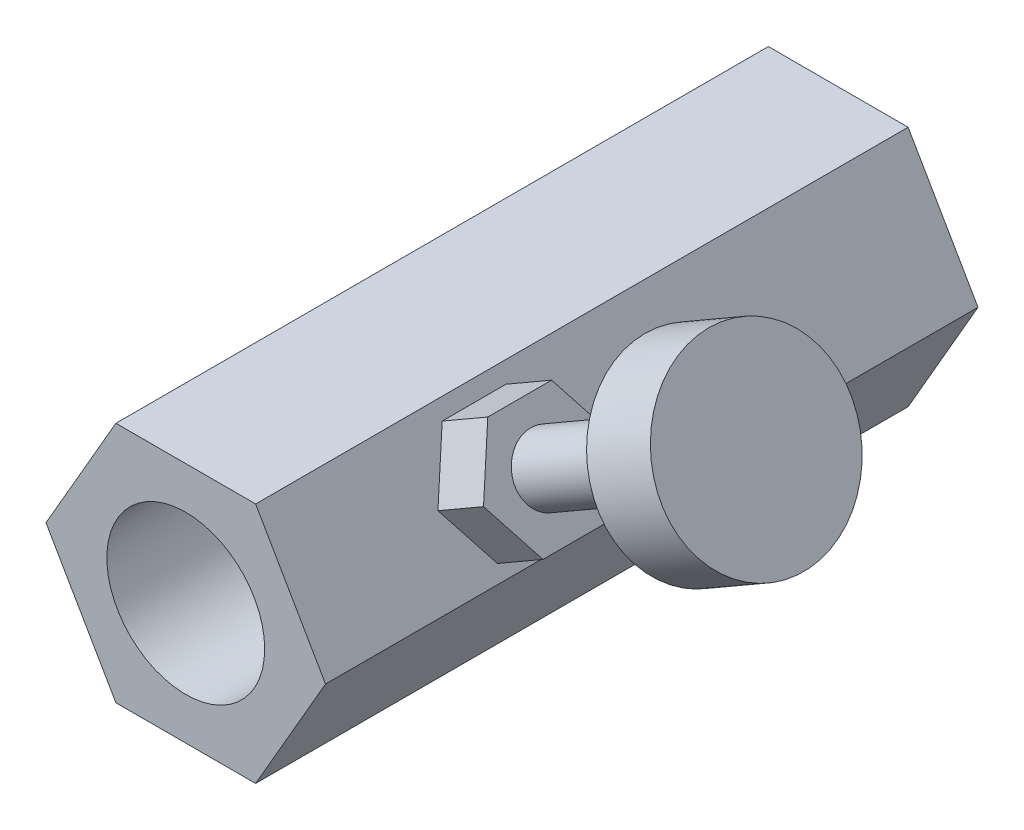
ISO-10303-21;
HEADER;
FILE_DESCRIPTION(('STEP AP214'),'2;1');
FILE_NAME('part.step','',(''),(''),'','','');
FILE_SCHEMA(('AUTOMOTIVE_DESIGN { 1 0 10303 214 1 1 1 1 }'));
ENDSEC;
DATA;
#1=APPLICATION_CONTEXT('core data for automotive mechanical design processes');
#2=APPLICATION_PROTOCOL_DEFINITION('international standard','automotive_design',2000,#1);
#3=PRODUCT_CONTEXT('',#1,'mechanical');
#4=PRODUCT('Part','Part','',(#3));
#5=PRODUCT_RELATED_PRODUCT_CATEGORY('part','',(#4));
#6=PRODUCT_DEFINITION_FORMATION('','',#4);
#7=PRODUCT_DEFINITION_CONTEXT('part definition',#1,'design');
#8=PRODUCT_DEFINITION('design','',#6,#7);
#9=PRODUCT_DEFINITION_SHAPE('','',#8);
#10=(LENGTH_UNIT() NAMED_UNIT(*) SI_UNIT(.MILLI.,.METRE.));
#11=(NAMED_UNIT(*) PLANE_ANGLE_UNIT() SI_UNIT($,.RADIAN.));
#12=(NAMED_UNIT(*) SI_UNIT($,.STERADIAN.) SOLID_ANGLE_UNIT());
#13=UNCERTAINTY_MEASURE_WITH_UNIT(LENGTH_MEASURE(1.E-05),#10,'distance_accuracy_value','');
#14=(GEOMETRIC_REPRESENTATION_CONTEXT(3) GLOBAL_UNCERTAINTY_ASSIGNED_CONTEXT((#13)) GLOBAL_UNIT_ASSIGNED_CONTEXT((#10,
#11,#12)) REPRESENTATION_CONTEXT('',''));
#15=CARTESIAN_POINT('',(0.,0.,0.));
#16=DIRECTION('',(0.,0.,1.));
#17=DIRECTION('',(1.,0.,0.));
#18=AXIS2_PLACEMENT_3D('',#15,#16,#17);
#19=CARTESIAN_POINT('',(-13.2790561913614,0.,-42.));
#20=DIRECTION('',(-0.866025403784439,-0.5,0.));
#21=DIRECTION('',(0.5,-0.866025403784439,0.));
#22=AXIS2_PLACEMENT_3D('',#19,#20,#21);
#23=PLANE('',#22);
#24=DIRECTION('',(0.,0.,1.));
#25=VECTOR('',#24,1.);
#26=CARTESIAN_POINT('',(-6.6395280956807,-11.5,-42.));
#27=LINE('',#26,#25);
#28=CARTESIAN_POINT('',(-6.6395280956807,-11.5,-42.));
#29=VERTEX_POINT('',#28);
#30=CARTESIAN_POINT('',(-6.6395280956807,-11.5,20.));
#31=VERTEX_POINT('',#30);
#32=EDGE_CURVE('E34',#29,#31,#27,.T.);
#33=ORIENTED_EDGE('',*,*,#32,.T.);
#34=DIRECTION('',(0.5,-0.866025403784439,0.));
#35=VECTOR('',#34,1.);
#36=CARTESIAN_POINT('',(-13.2790561913614,0.,20.));
#37=LINE('',#36,#35);
#38=CARTESIAN_POINT('',(-13.2790561913614,0.,20.));
#39=VERTEX_POINT('',#38);
#40=EDGE_CURVE('E246',#39,#31,#37,.T.);
#41=ORIENTED_EDGE('',*,*,#40,.F.);
#42=DIRECTION('',(0.,0.,1.));
#43=VECTOR('',#42,1.);
#44=CARTESIAN_POINT('',(-13.2790561913614,0.,-42.));
#45=LINE('',#44,#43);
#46=CARTESIAN_POINT('',(-13.2790561913614,0.,-42.));
#47=VERTEX_POINT('',#46);
#48=EDGE_CURVE('E11',#47,#39,#45,.T.);
#49=ORIENTED_EDGE('',*,*,#48,.F.);
#50=DIRECTION('',(0.5,-0.866025403784439,0.));
#51=VECTOR('',#50,1.);
#52=CARTESIAN_POINT('',(-13.2790561913614,0.,-42.));
#53=LINE('',#52,#51);
#54=EDGE_CURVE('E264',#47,#29,#53,.T.);
#55=ORIENTED_EDGE('',*,*,#54,.T.);
#56=EDGE_LOOP('',(#33,#41,#49,#55));
#57=FACE_BOUND('',#56,.T.);
#58=DIRECTION('',(0.,0.,1.));
#59=VECTOR('',#58,1.);
#60=CARTESIAN_POINT('',(-7.22929214352105,-10.478498704663,-16.7322101021105));
#61=LINE('',#60,#59);
#62=CARTESIAN_POINT('',(-7.22929214352105,-10.478498704663,-16.7322101021105));
#63=VERTEX_POINT('',#62);
#64=CARTESIAN_POINT('',(-7.22929214352105,-10.478498704663,-10.4275451625598));
#65=VERTEX_POINT('',#64);
#66=EDGE_CURVE('E558',#63,#65,#61,.T.);
#67=ORIENTED_EDGE('',*,*,#66,.F.);
#68=DIRECTION('',(0.433012701892219,-0.75,0.5));
#69=VECTOR('',#68,1.);
#70=CARTESIAN_POINT('',(-9.95929214352105,-5.75,-19.8845425718858));
#71=LINE('',#70,#69);
#72=CARTESIAN_POINT('',(-9.95929214352105,-5.75,-19.8845425718858));
#73=VERTEX_POINT('',#72);
#74=EDGE_CURVE('E180',#73,#63,#71,.T.);
#75=ORIENTED_EDGE('',*,*,#74,.F.);
#76=DIRECTION('',(0.433012701892219,-0.75,-0.5));
#77=VECTOR('',#76,1.);
#78=CARTESIAN_POINT('',(-12.6892921435211,-1.02150129533697,-16.7322101021105));
#79=LINE('',#78,#77);
#80=CARTESIAN_POINT('',(-12.689292143521,-1.02150129533697,-16.7322101021105));
#81=VERTEX_POINT('',#80);
#82=EDGE_CURVE('E176',#81,#73,#79,.T.);
#83=ORIENTED_EDGE('',*,*,#82,.F.);
#84=DIRECTION('',(0.,0.,-1.));
#85=VECTOR('',#84,1.);
#86=CARTESIAN_POINT('',(-12.6892921435211,-1.02150129533697,-10.4275451625598));
#87=LINE('',#86,#85);
#88=CARTESIAN_POINT('',(-12.6892921435211,-1.02150129533697,-10.4275451625598));
#89=VERTEX_POINT('',#88);
#90=EDGE_CURVE('E554',#89,#81,#87,.T.);
#91=ORIENTED_EDGE('',*,*,#90,.F.);
#92=DIRECTION('',(-0.433012701892219,0.75,-0.5));
#93=VECTOR('',#92,1.);
#94=CARTESIAN_POINT('',(-9.95929214352105,-5.75,-7.2752126927844));
#95=LINE('',#94,#93);
#96=CARTESIAN_POINT('',(-9.95929214352105,-5.75,-7.2752126927844));
#97=VERTEX_POINT('',#96);
#98=EDGE_CURVE('E566',#97,#89,#95,.T.);
#99=ORIENTED_EDGE('',*,*,#98,.F.);
#100=DIRECTION('',(-0.433012701892219,0.75,0.5));
#101=VECTOR('',#100,1.);
#102=CARTESIAN_POINT('',(-7.22929214352105,-10.478498704663,-10.4275451625598));
#103=LINE('',#102,#101);
#104=EDGE_CURVE('E560',#65,#97,#103,.T.);
#105=ORIENTED_EDGE('',*,*,#104,.F.);
#106=EDGE_LOOP('',(#67,#75,#83,#91,#99,#105));
#107=FACE_BOUND('',#106,.T.);
#108=ADVANCED_FACE('F31',(#57,#107),#23,.T.);
#109=CARTESIAN_POINT('',(16.9680270050212,3.61051512310253,3.02058891512608));
#110=DIRECTION('',(0.866025403784438,0.5,0.));
#111=DIRECTION('',(-0.5,0.866025403784439,0.));
#112=AXIS2_PLACEMENT_3D('',#109,#110,#111);
#113=PLANE('',#112);
#114=DIRECTION('',(0.433012701892219,-0.75,-0.5));
#115=VECTOR('',#114,1.);
#116=CARTESIAN_POINT('',(14.3430270050212,8.15714849297083,6.05167782837162));
#117=LINE('',#116,#115);
#118=CARTESIAN_POINT('',(14.3430270050212,8.15714849297083,6.05167782837162));
#119=VERTEX_POINT('',#118);
#120=CARTESIAN_POINT('',(16.9680270050212,3.61051512310253,3.02058891512608));
#121=VERTEX_POINT('',#120);
#122=EDGE_CURVE('E200',#119,#121,#117,.T.);
#123=ORIENTED_EDGE('',*,*,#122,.T.);
#124=DIRECTION('',(0.,0.,-1.));
#125=VECTOR('',#124,1.);
#126=CARTESIAN_POINT('',(16.9680270050212,3.61051512310253,3.02058891512608));
#127=LINE('',#126,#125);
#128=CARTESIAN_POINT('',(16.9680270050212,3.61051512310253,-3.04158891136499));
#129=VERTEX_POINT('',#128);
#130=EDGE_CURVE('E203',#121,#129,#127,.T.);
#131=ORIENTED_EDGE('',*,*,#130,.T.);
#132=DIRECTION('',(-0.433012701892219,0.75,-0.5));
#133=VECTOR('',#132,1.);
#134=CARTESIAN_POINT('',(16.9680270050212,3.61051512310253,-3.04158891136499));
#135=LINE('',#134,#133);
#136=CARTESIAN_POINT('',(14.3430270050212,8.15714849297083,-6.07267782461052));
#137=VERTEX_POINT('',#136);
#138=EDGE_CURVE('E206',#129,#137,#135,.T.);
#139=ORIENTED_EDGE('',*,*,#138,.T.);
#140=DIRECTION('',(-0.43301270189222,0.75,0.5));
#141=VECTOR('',#140,1.);
#142=CARTESIAN_POINT('',(14.3430270050212,8.15714849297083,-6.07267782461052));
#143=LINE('',#142,#141);
#144=CARTESIAN_POINT('',(11.7180270050212,12.7037818628391,-3.04158891136498));
#145=VERTEX_POINT('',#144);
#146=EDGE_CURVE('E208',#137,#145,#143,.T.);
#147=ORIENTED_EDGE('',*,*,#146,.T.);
#148=DIRECTION('',(0.,0.,1.));
#149=VECTOR('',#148,1.);
#150=CARTESIAN_POINT('',(11.7180270050212,12.7037818628391,-3.04158891136498));
#151=LINE('',#150,#149);
#152=CARTESIAN_POINT('',(11.7180270050212,12.7037818628391,3.02058891512608));
#153=VERTEX_POINT('',#152);
#154=EDGE_CURVE('E210',#145,#153,#151,.T.);
#155=ORIENTED_EDGE('',*,*,#154,.T.);
#156=DIRECTION('',(0.433012701892219,-0.75,0.5));
#157=VECTOR('',#156,1.);
#158=CARTESIAN_POINT('',(11.7180270050212,12.7037818628391,3.02058891512608));
#159=LINE('',#158,#157);
#160=EDGE_CURVE('E212',#153,#119,#159,.T.);
#161=ORIENTED_EDGE('',*,*,#160,.T.);
#162=EDGE_LOOP('',(#123,#131,#139,#147,#155,#161));
#163=FACE_BOUND('',#162,.T.);
#164=CARTESIAN_POINT('',(14.2894191624432,8.25000000000001,0.));
#165=DIRECTION('',(0.866025403784438,0.5,0.));
#166=DIRECTION('',(-0.5,0.866025403784438,0.));
#167=AXIS2_PLACEMENT_3D('',#164,#165,#166);
#168=CIRCLE('',#167,3.);
#169=CARTESIAN_POINT('',(12.7894191624432,10.8480762113533,0.));
#170=VERTEX_POINT('',#169);
#171=EDGE_CURVE('E192',#170,#170,#168,.T.);
#172=ORIENTED_EDGE('',*,*,#171,.F.);
#173=EDGE_LOOP('',(#172));
#174=FACE_BOUND('',#173,.T.);
#175=ADVANCED_FACE('F326',(#163,#174),#113,.T.);
#176=CARTESIAN_POINT('',(13.2790561913614,0.,-42.));
#177=DIRECTION('',(0.866025403784439,0.5,0.));
#178=DIRECTION('',(-0.5,0.866025403784439,0.));
#179=AXIS2_PLACEMENT_3D('',#176,#177,#178);
#180=PLANE('',#179);
#181=DIRECTION('',(0.,0.,1.));
#182=VECTOR('',#181,1.);
#183=CARTESIAN_POINT('',(6.6395280956807,11.5,-42.));
#184=LINE('',#183,#182);
#185=CARTESIAN_POINT('',(6.6395280956807,11.5,-42.));
#186=VERTEX_POINT('',#185);
#187=CARTESIAN_POINT('',(6.6395280956807,11.5,20.));
#188=VERTEX_POINT('',#187);
#189=EDGE_CURVE('E283',#186,#188,#184,.T.);
#190=ORIENTED_EDGE('',*,*,#189,.T.);
#191=DIRECTION('',(-0.5,0.866025403784439,0.));
#192=VECTOR('',#191,1.);
#193=CARTESIAN_POINT('',(13.2790561913614,0.,20.));
#194=LINE('',#193,#192);
#195=CARTESIAN_POINT('',(13.2790561913614,0.,20.));
#196=VERTEX_POINT('',#195);
#197=EDGE_CURVE('E255',#196,#188,#194,.T.);
#198=ORIENTED_EDGE('',*,*,#197,.F.);
#199=DIRECTION('',(0.,0.,1.));
#200=VECTOR('',#199,1.);
#201=CARTESIAN_POINT('',(13.2790561913614,0.,-42.));
#202=LINE('',#201,#200);
#203=CARTESIAN_POINT('',(13.2790561913614,0.,-42.));
#204=VERTEX_POINT('',#203);
#205=EDGE_CURVE('E285',#204,#196,#202,.T.);
#206=ORIENTED_EDGE('',*,*,#205,.F.);
#207=DIRECTION('',(-0.5,0.866025403784439,0.));
#208=VECTOR('',#207,1.);
#209=CARTESIAN_POINT('',(13.2790561913614,0.,-42.));
#210=LINE('',#209,#208);
#211=EDGE_CURVE('E273',#204,#186,#210,.T.);
#212=ORIENTED_EDGE('',*,*,#211,.T.);
#213=EDGE_LOOP('',(#190,#198,#206,#212));
#214=FACE_BOUND('',#213,.T.);
#215=DIRECTION('',(0.,0.,-1.));
#216=VECTOR('',#215,1.);
#217=CARTESIAN_POINT('',(12.637899986099,1.11051512310253,3.02058891512608));
#218=LINE('',#217,#216);
#219=CARTESIAN_POINT('',(12.637899986099,1.11051512310253,3.02058891512608));
#220=VERTEX_POINT('',#219);
#221=CARTESIAN_POINT('',(12.637899986099,1.11051512310253,-3.04158891136499));
#222=VERTEX_POINT('',#221);
#223=EDGE_CURVE('E217',#220,#222,#218,.T.);
#224=ORIENTED_EDGE('',*,*,#223,.F.);
#225=DIRECTION('',(0.433012701892219,-0.75,-0.5));
#226=VECTOR('',#225,1.);
#227=CARTESIAN_POINT('',(10.012899986099,5.65714849297083,6.05167782837162));
#228=LINE('',#227,#226);
#229=CARTESIAN_POINT('',(10.012899986099,5.65714849297083,6.05167782837162));
#230=VERTEX_POINT('',#229);
#231=EDGE_CURVE('E197',#230,#220,#228,.T.);
#232=ORIENTED_EDGE('',*,*,#231,.F.);
#233=DIRECTION('',(0.433012701892219,-0.75,0.5));
#234=VECTOR('',#233,1.);
#235=CARTESIAN_POINT('',(7.387899986099,10.2037818628391,3.02058891512608));
#236=LINE('',#235,#234);
#237=CARTESIAN_POINT('',(7.387899986099,10.2037818628391,3.02058891512608));
#238=VERTEX_POINT('',#237);
#239=EDGE_CURVE('E204',#238,#230,#236,.T.);
#240=ORIENTED_EDGE('',*,*,#239,.F.);
#241=DIRECTION('',(0.,0.,1.));
#242=VECTOR('',#241,1.);
#243=CARTESIAN_POINT('',(7.387899986099,10.2037818628391,-3.04158891136498));
#244=LINE('',#243,#242);
#245=CARTESIAN_POINT('',(7.387899986099,10.2037818628391,-3.04158891136498));
#246=VERTEX_POINT('',#245);
#247=EDGE_CURVE('E223',#246,#238,#244,.T.);
#248=ORIENTED_EDGE('',*,*,#247,.F.);
#249=DIRECTION('',(-0.43301270189222,0.75,0.5));
#250=VECTOR('',#249,1.);
#251=CARTESIAN_POINT('',(10.012899986099,5.65714849297083,-6.07267782461052));
#252=LINE('',#251,#250);
#253=CARTESIAN_POINT('',(10.012899986099,5.65714849297083,-6.07267782461052));
#254=VERTEX_POINT('',#253);
#255=EDGE_CURVE('E221',#254,#246,#252,.T.);
#256=ORIENTED_EDGE('',*,*,#255,.F.);
#257=DIRECTION('',(-0.433012701892219,0.75,-0.5));
#258=VECTOR('',#257,1.);
#259=CARTESIAN_POINT('',(12.637899986099,1.11051512310253,-3.04158891136499));
#260=LINE('',#259,#258);
#261=EDGE_CURVE('E219',#222,#254,#260,.T.);
#262=ORIENTED_EDGE('',*,*,#261,.F.);
#263=EDGE_LOOP('',(#224,#232,#240,#248,#256,#262));
#264=FACE_BOUND('',#263,.T.);
#265=ADVANCED_FACE('F312',(#214,#264),#180,.T.);
#266=CARTESIAN_POINT('',(-6.63952809568069,11.5,-42.));
#267=DIRECTION('',(-0.866025403784439,0.5,0.));
#268=DIRECTION('',(-0.5,-0.866025403784439,0.));
#269=AXIS2_PLACEMENT_3D('',#266,#267,#268);
#270=PLANE('',#269);
#271=ORIENTED_EDGE('',*,*,#48,.T.);
#272=DIRECTION('',(-0.5,-0.866025403784439,0.));
#273=VECTOR('',#272,1.);
#274=CARTESIAN_POINT('',(-6.63952809568069,11.5,20.));
#275=LINE('',#274,#273);
#276=CARTESIAN_POINT('',(-6.63952809568069,11.5,20.));
#277=VERTEX_POINT('',#276);
#278=EDGE_CURVE('E261',#277,#39,#275,.T.);
#279=ORIENTED_EDGE('',*,*,#278,.F.);
#280=DIRECTION('',(0.,0.,1.));
#281=VECTOR('',#280,1.);
#282=CARTESIAN_POINT('',(-6.63952809568069,11.5,-42.));
#283=LINE('',#282,#281);
#284=CARTESIAN_POINT('',(-6.63952809568069,11.5,-42.));
#285=VERTEX_POINT('',#284);
#286=EDGE_CURVE('E39',#285,#277,#283,.T.);
#287=ORIENTED_EDGE('',*,*,#286,.F.);
#288=DIRECTION('',(-0.5,-0.866025403784439,0.));
#289=VECTOR('',#288,1.);
#290=CARTESIAN_POINT('',(-6.63952809568069,11.5,-42.));
#291=LINE('',#290,#289);
#292=EDGE_CURVE('E279',#285,#47,#291,.T.);
#293=ORIENTED_EDGE('',*,*,#292,.T.);
#294=EDGE_LOOP('',(#271,#279,#287,#293));
#295=FACE_BOUND('',#294,.T.);
#296=ADVANCED_FACE('F301',(#295),#270,.T.);
#297=CARTESIAN_POINT('',(6.6395280956807,11.5,-42.));
#298=DIRECTION('',(0.,1.,0.));
#299=DIRECTION('',(-1.,0.,0.));
#300=AXIS2_PLACEMENT_3D('',#297,#298,#299);
#301=PLANE('',#300);
#302=ORIENTED_EDGE('',*,*,#286,.T.);
#303=DIRECTION('',(-1.,0.,0.));
#304=VECTOR('',#303,1.);
#305=CARTESIAN_POINT('',(6.6395280956807,11.5,20.));
#306=LINE('',#305,#304);
#307=EDGE_CURVE('E258',#188,#277,#306,.T.);
#308=ORIENTED_EDGE('',*,*,#307,.F.);
#309=ORIENTED_EDGE('',*,*,#189,.F.);
#310=DIRECTION('',(-1.,0.,0.));
#311=VECTOR('',#310,1.);
#312=CARTESIAN_POINT('',(6.6395280956807,11.5,-42.));
#313=LINE('',#312,#311);
#314=EDGE_CURVE('E276',#186,#285,#313,.T.);
#315=ORIENTED_EDGE('',*,*,#314,.T.);
#316=EDGE_LOOP('',(#302,#308,#309,#315));
#317=FACE_BOUND('',#316,.T.);
#318=ADVANCED_FACE('F315',(#317),#301,.T.);
#319=CARTESIAN_POINT('',(6.6395280956807,-11.5,-42.));
#320=DIRECTION('',(0.866025403784438,-0.5,0.));
#321=DIRECTION('',(0.5,0.866025403784438,0.));
#322=AXIS2_PLACEMENT_3D('',#319,#320,#321);
#323=PLANE('',#322);
#324=ORIENTED_EDGE('',*,*,#205,.T.);
#325=DIRECTION('',(0.5,0.866025403784438,0.));
#326=VECTOR('',#325,1.);
#327=CARTESIAN_POINT('',(6.6395280956807,-11.5,20.));
#328=LINE('',#327,#326);
#329=CARTESIAN_POINT('',(6.6395280956807,-11.5,20.));
#330=VERTEX_POINT('',#329);
#331=EDGE_CURVE('E252',#330,#196,#328,.T.);
#332=ORIENTED_EDGE('',*,*,#331,.F.);
#333=DIRECTION('',(0.,0.,1.));
#334=VECTOR('',#333,1.);
#335=CARTESIAN_POINT('',(6.6395280956807,-11.5,-42.));
#336=LINE('',#335,#334);
#337=CARTESIAN_POINT('',(6.6395280956807,-11.5,-42.));
#338=VERTEX_POINT('',#337);
#339=EDGE_CURVE('E286',#338,#330,#336,.T.);
#340=ORIENTED_EDGE('',*,*,#339,.F.);
#341=DIRECTION('',(0.5,0.866025403784438,0.));
#342=VECTOR('',#341,1.);
#343=CARTESIAN_POINT('',(6.6395280956807,-11.5,-42.));
#344=LINE('',#343,#342);
#345=EDGE_CURVE('E270',#338,#204,#344,.T.);
#346=ORIENTED_EDGE('',*,*,#345,.T.);
#347=EDGE_LOOP('',(#324,#332,#340,#346));
#348=FACE_BOUND('',#347,.T.);
#349=ADVANCED_FACE('F309',(#348),#323,.T.);
#350=CARTESIAN_POINT('',(-6.6395280956807,-11.5,-42.));
#351=DIRECTION('',(0.,-1.,0.));
#352=DIRECTION('',(0.,0.,-1.));
#353=AXIS2_PLACEMENT_3D('',#350,#351,#352);
#354=PLANE('',#353);
#355=ORIENTED_EDGE('',*,*,#339,.T.);
#356=DIRECTION('',(1.,0.,0.));
#357=VECTOR('',#356,1.);
#358=CARTESIAN_POINT('',(-6.6395280956807,-11.5,20.));
#359=LINE('',#358,#357);
#360=EDGE_CURVE('E249',#31,#330,#359,.T.);
#361=ORIENTED_EDGE('',*,*,#360,.F.);
#362=ORIENTED_EDGE('',*,*,#32,.F.);
#363=DIRECTION('',(1.,0.,0.));
#364=VECTOR('',#363,1.);
#365=CARTESIAN_POINT('',(-6.6395280956807,-11.5,-42.));
#366=LINE('',#365,#364);
#367=EDGE_CURVE('E267',#29,#338,#366,.T.);
#368=ORIENTED_EDGE('',*,*,#367,.T.);
#369=EDGE_LOOP('',(#355,#361,#362,#368));
#370=FACE_BOUND('',#369,.T.);
#371=ADVANCED_FACE('F294',(#370),#354,.T.);
#372=CARTESIAN_POINT('',(-6.6395280956807,-11.5,-42.));
#373=DIRECTION('',(0.,0.,1.));
#374=DIRECTION('',(1.,0.,0.));
#375=AXIS2_PLACEMENT_3D('',#372,#373,#374);
#376=PLANE('',#375);
#377=CARTESIAN_POINT('',(0.,0.,-42.));
#378=DIRECTION('',(0.,0.,1.));
#379=DIRECTION('',(1.,0.,0.));
#380=AXIS2_PLACEMENT_3D('',#377,#378,#379);
#381=CIRCLE('',#380,7.5);
#382=CARTESIAN_POINT('',(7.5,0.,-42.));
#383=VERTEX_POINT('',#382);
#384=EDGE_CURVE('E243',#383,#383,#381,.T.);
#385=ORIENTED_EDGE('',*,*,#384,.T.);
#386=EDGE_LOOP('',(#385));
#387=FACE_BOUND('',#386,.T.);
#388=ORIENTED_EDGE('',*,*,#54,.F.);
#389=ORIENTED_EDGE('',*,*,#292,.F.);
#390=ORIENTED_EDGE('',*,*,#314,.F.);
#391=ORIENTED_EDGE('',*,*,#211,.F.);
#392=ORIENTED_EDGE('',*,*,#345,.F.);
#393=ORIENTED_EDGE('',*,*,#367,.F.);
#394=EDGE_LOOP('',(#388,#389,#390,#391,#392,#393));
#395=FACE_BOUND('',#394,.T.);
#396=ADVANCED_FACE('F304',(#387,#395),#376,.F.);
#397=CARTESIAN_POINT('',(-6.6395280956807,-11.5,20.));
#398=DIRECTION('',(0.,0.,1.));
#399=DIRECTION('',(1.,0.,0.));
#400=AXIS2_PLACEMENT_3D('',#397,#398,#399);
#401=PLANE('',#400);
#402=CARTESIAN_POINT('',(0.,0.,20.));
#403=DIRECTION('',(0.,0.,1.));
#404=DIRECTION('',(1.,0.,0.));
#405=AXIS2_PLACEMENT_3D('',#402,#403,#404);
#406=CIRCLE('',#405,7.5);
#407=CARTESIAN_POINT('',(7.5,0.,20.));
#408=VERTEX_POINT('',#407);
#409=EDGE_CURVE('E240',#408,#408,#406,.T.);
#410=ORIENTED_EDGE('',*,*,#409,.F.);
#411=EDGE_LOOP('',(#410));
#412=FACE_BOUND('',#411,.T.);
#413=ORIENTED_EDGE('',*,*,#40,.T.);
#414=ORIENTED_EDGE('',*,*,#360,.T.);
#415=ORIENTED_EDGE('',*,*,#331,.T.);
#416=ORIENTED_EDGE('',*,*,#197,.T.);
#417=ORIENTED_EDGE('',*,*,#307,.T.);
#418=ORIENTED_EDGE('',*,*,#278,.T.);
#419=EDGE_LOOP('',(#413,#414,#415,#416,#417,#418));
#420=FACE_BOUND('',#419,.T.);
#421=ADVANCED_FACE('F297',(#412,#420),#401,.T.);
#422=CARTESIAN_POINT('',(0.,0.,-45.));
#423=DIRECTION('',(0.,0.,1.));
#424=DIRECTION('',(1.,0.,0.));
#425=AXIS2_PLACEMENT_3D('',#422,#423,#424);
#426=CYLINDRICAL_SURFACE('',#425,7.5);
#427=ORIENTED_EDGE('',*,*,#409,.T.);
#428=EDGE_LOOP('',(#427));
#429=FACE_BOUND('',#428,.T.);
#430=ORIENTED_EDGE('',*,*,#384,.F.);
#431=EDGE_LOOP('',(#430));
#432=FACE_BOUND('',#431,.T.);
#433=ADVANCED_FACE('F362',(#429,#432),#426,.F.);
#434=CARTESIAN_POINT('',(14.3430270050212,8.15714849297083,6.05167782837162));
#435=DIRECTION('',(-0.25,0.43301270189222,-0.866025403784439));
#436=DIRECTION('',(0.,0.894427190999916,0.447213595499958));
#437=AXIS2_PLACEMENT_3D('',#434,#435,#436);
#438=PLANE('',#437);
#439=ORIENTED_EDGE('',*,*,#231,.T.);
#440=DIRECTION('',(-0.866025403784439,-0.5,0.));
#441=VECTOR('',#440,1.);
#442=CARTESIAN_POINT('',(16.9680270050212,3.61051512310253,3.02058891512608));
#443=LINE('',#442,#441);
#444=EDGE_CURVE('E238',#121,#220,#443,.T.);
#445=ORIENTED_EDGE('',*,*,#444,.F.);
#446=ORIENTED_EDGE('',*,*,#122,.F.);
#447=DIRECTION('',(-0.866025403784439,-0.5,0.));
#448=VECTOR('',#447,1.);
#449=CARTESIAN_POINT('',(14.3430270050212,8.15714849297083,6.05167782837162));
#450=LINE('',#449,#448);
#451=EDGE_CURVE('E214',#119,#230,#450,.T.);
#452=ORIENTED_EDGE('',*,*,#451,.T.);
#453=EDGE_LOOP('',(#439,#445,#446,#452));
#454=FACE_BOUND('',#453,.T.);
#455=ADVANCED_FACE('F358',(#454),#438,.F.);
#456=CARTESIAN_POINT('',(16.9680270050212,3.61051512310253,3.02058891512608));
#457=DIRECTION('',(-0.5,0.866025403784439,0.));
#458=DIRECTION('',(-0.866025403784439,-0.5,0.));
#459=AXIS2_PLACEMENT_3D('',#456,#457,#458);
#460=PLANE('',#459);
#461=ORIENTED_EDGE('',*,*,#223,.T.);
#462=DIRECTION('',(-0.866025403784439,-0.5,0.));
#463=VECTOR('',#462,1.);
#464=CARTESIAN_POINT('',(16.9680270050212,3.61051512310253,-3.04158891136499));
#465=LINE('',#464,#463);
#466=EDGE_CURVE('E235',#129,#222,#465,.T.);
#467=ORIENTED_EDGE('',*,*,#466,.F.);
#468=ORIENTED_EDGE('',*,*,#130,.F.);
#469=ORIENTED_EDGE('',*,*,#444,.T.);
#470=EDGE_LOOP('',(#461,#467,#468,#469));
#471=FACE_BOUND('',#470,.T.);
#472=ADVANCED_FACE('F354',(#471),#460,.F.);
#473=CARTESIAN_POINT('',(16.9680270050212,3.61051512310253,-3.04158891136499));
#474=DIRECTION('',(-0.25,0.433012701892219,0.866025403784439));
#475=DIRECTION('',(0.,-0.894427190999916,0.447213595499958));
#476=AXIS2_PLACEMENT_3D('',#473,#474,#475);
#477=PLANE('',#476);
#478=ORIENTED_EDGE('',*,*,#261,.T.);
#479=DIRECTION('',(-0.866025403784439,-0.5,0.));
#480=VECTOR('',#479,1.);
#481=CARTESIAN_POINT('',(14.3430270050212,8.15714849297083,-6.07267782461052));
#482=LINE('',#481,#480);
#483=EDGE_CURVE('E232',#137,#254,#482,.T.);
#484=ORIENTED_EDGE('',*,*,#483,.F.);
#485=ORIENTED_EDGE('',*,*,#138,.F.);
#486=ORIENTED_EDGE('',*,*,#466,.T.);
#487=EDGE_LOOP('',(#478,#484,#485,#486));
#488=FACE_BOUND('',#487,.T.);
#489=ADVANCED_FACE('F350',(#488),#477,.F.);
#490=CARTESIAN_POINT('',(14.3430270050212,8.15714849297083,-6.07267782461052));
#491=DIRECTION('',(0.25,-0.43301270189222,0.866025403784438));
#492=DIRECTION('',(0.,-0.894427190999916,-0.447213595499958));
#493=AXIS2_PLACEMENT_3D('',#490,#491,#492);
#494=PLANE('',#493);
#495=ORIENTED_EDGE('',*,*,#255,.T.);
#496=DIRECTION('',(-0.866025403784439,-0.5,0.));
#497=VECTOR('',#496,1.);
#498=CARTESIAN_POINT('',(11.7180270050212,12.7037818628391,-3.04158891136498));
#499=LINE('',#498,#497);
#500=EDGE_CURVE('E229',#145,#246,#499,.T.);
#501=ORIENTED_EDGE('',*,*,#500,.F.);
#502=ORIENTED_EDGE('',*,*,#146,.F.);
#503=ORIENTED_EDGE('',*,*,#483,.T.);
#504=EDGE_LOOP('',(#495,#501,#502,#503));
#505=FACE_BOUND('',#504,.T.);
#506=ADVANCED_FACE('F346',(#505),#494,.F.);
#507=CARTESIAN_POINT('',(11.7180270050212,12.7037818628391,-3.04158891136498));
#508=DIRECTION('',(0.5,-0.866025403784439,0.));
#509=DIRECTION('',(0.866025403784439,0.5,0.));
#510=AXIS2_PLACEMENT_3D('',#507,#508,#509);
#511=PLANE('',#510);
#512=ORIENTED_EDGE('',*,*,#247,.T.);
#513=DIRECTION('',(-0.866025403784439,-0.5,0.));
#514=VECTOR('',#513,1.);
#515=CARTESIAN_POINT('',(11.7180270050212,12.7037818628391,3.02058891512608));
#516=LINE('',#515,#514);
#517=EDGE_CURVE('E55',#153,#238,#516,.T.);
#518=ORIENTED_EDGE('',*,*,#517,.F.);
#519=ORIENTED_EDGE('',*,*,#154,.F.);
#520=ORIENTED_EDGE('',*,*,#500,.T.);
#521=EDGE_LOOP('',(#512,#518,#519,#520));
#522=FACE_BOUND('',#521,.T.);
#523=ADVANCED_FACE('F343',(#522),#511,.F.);
#524=CARTESIAN_POINT('',(11.7180270050212,12.7037818628391,3.02058891512608));
#525=DIRECTION('',(0.25,-0.433012701892219,-0.866025403784439));
#526=DIRECTION('',(0.,0.894427190999916,-0.447213595499958));
#527=AXIS2_PLACEMENT_3D('',#524,#525,#526);
#528=PLANE('',#527);
#529=ORIENTED_EDGE('',*,*,#239,.T.);
#530=ORIENTED_EDGE('',*,*,#451,.F.);
#531=ORIENTED_EDGE('',*,*,#160,.F.);
#532=ORIENTED_EDGE('',*,*,#517,.T.);
#533=EDGE_LOOP('',(#529,#530,#531,#532));
#534=FACE_BOUND('',#533,.T.);
#535=ADVANCED_FACE('F340',(#534),#528,.F.);
#536=CARTESIAN_POINT('',(28.1458256229943,16.25,0.));
#537=DIRECTION('',(-0.866025403784438,-0.5,0.));
#538=DIRECTION('',(0.5,-0.866025403784438,0.));
#539=AXIS2_PLACEMENT_3D('',#536,#537,#538);
#540=CYLINDRICAL_SURFACE('',#539,3.);
#541=CARTESIAN_POINT('',(28.1458256229943,16.25,0.));
#542=DIRECTION('',(0.866025403784438,0.5,0.));
#543=DIRECTION('',(-0.5,0.866025403784438,0.));
#544=AXIS2_PLACEMENT_3D('',#541,#542,#543);
#545=CIRCLE('',#544,3.);
#546=CARTESIAN_POINT('',(26.6458256229943,18.8480762113533,0.));
#547=VERTEX_POINT('',#546);
#548=EDGE_CURVE('E194',#547,#547,#545,.T.);
#549=ORIENTED_EDGE('',*,*,#548,.F.);
#550=EDGE_LOOP('',(#549));
#551=FACE_BOUND('',#550,.T.);
#552=ORIENTED_EDGE('',*,*,#171,.T.);
#553=EDGE_LOOP('',(#552));
#554=FACE_BOUND('',#553,.T.);
#555=ADVANCED_FACE('F338',(#551,#554),#540,.T.);
#556=CARTESIAN_POINT('',(28.1458256229943,16.25,0.));
#557=DIRECTION('',(0.866025403784439,0.5,0.));
#558=DIRECTION('',(-0.5,0.866025403784438,0.));
#559=AXIS2_PLACEMENT_3D('',#556,#557,#558);
#560=PLANE('',#559);
#561=CARTESIAN_POINT('',(28.1458256229943,16.25,0.));
#562=DIRECTION('',(0.866025403784439,0.5,0.));
#563=DIRECTION('',(-0.5,0.866025403784438,0.));
#564=AXIS2_PLACEMENT_3D('',#561,#562,#563);
#565=CIRCLE('',#564,9.);
#566=CARTESIAN_POINT('',(23.6458256229942,24.04422863406,0.));
#567=VERTEX_POINT('',#566);
#568=EDGE_CURVE('E182',#567,#567,#565,.T.);
#569=ORIENTED_EDGE('',*,*,#568,.F.);
#570=EDGE_LOOP('',(#569));
#571=FACE_BOUND('',#570,.T.);
#572=ORIENTED_EDGE('',*,*,#548,.T.);
#573=EDGE_LOOP('',(#572));
#574=FACE_BOUND('',#573,.T.);
#575=ADVANCED_FACE('F452',(#571,#574),#560,.F.);
#576=CARTESIAN_POINT('',(34.2080034494853,19.75,0.));
#577=DIRECTION('',(-0.866025403784438,-0.5,0.));
#578=DIRECTION('',(0.5,-0.866025403784438,0.));
#579=AXIS2_PLACEMENT_3D('',#576,#577,#578);
#580=CYLINDRICAL_SURFACE('',#579,9.);
#581=CARTESIAN_POINT('',(34.2080034494853,19.75,0.));
#582=DIRECTION('',(0.866025403784439,0.5,0.));
#583=DIRECTION('',(-0.5,0.866025403784438,0.));
#584=AXIS2_PLACEMENT_3D('',#581,#582,#583);
#585=CIRCLE('',#584,9.);
#586=CARTESIAN_POINT('',(29.7080034494853,27.54422863406,0.));
#587=VERTEX_POINT('',#586);
#588=EDGE_CURVE('E185',#587,#587,#585,.T.);
#589=ORIENTED_EDGE('',*,*,#588,.F.);
#590=EDGE_LOOP('',(#589));
#591=FACE_BOUND('',#590,.T.);
#592=ORIENTED_EDGE('',*,*,#568,.T.);
#593=EDGE_LOOP('',(#592));
#594=FACE_BOUND('',#593,.T.);
#595=ADVANCED_FACE('F461',(#591,#594),#580,.T.);
#596=CARTESIAN_POINT('',(34.2080034494853,19.75,0.));
#597=DIRECTION('',(0.866025403784439,0.5,0.));
#598=DIRECTION('',(-0.5,0.866025403784438,0.));
#599=AXIS2_PLACEMENT_3D('',#596,#597,#598);
#600=PLANE('',#599);
#601=ORIENTED_EDGE('',*,*,#588,.T.);
#602=EDGE_LOOP('',(#601));
#603=FACE_BOUND('',#602,.T.);
#604=ADVANCED_FACE('F471',(#603),#600,.T.);
#605=CARTESIAN_POINT('',(-16.0214699700121,-9.25,-19.8845425718858));
#606=DIRECTION('',(-0.25,0.433012701892219,0.866025403784438));
#607=DIRECTION('',(0.,-0.894427190999916,0.447213595499958));
#608=AXIS2_PLACEMENT_3D('',#605,#606,#607);
#609=PLANE('',#608);
#610=ORIENTED_EDGE('',*,*,#74,.T.);
#611=DIRECTION('',(0.866025403784439,0.5,0.));
#612=VECTOR('',#611,1.);
#613=CARTESIAN_POINT('',(-13.2914699700121,-13.978498704663,-16.7322101021105));
#614=LINE('',#613,#612);
#615=CARTESIAN_POINT('',(-13.2914699700121,-13.978498704663,-16.7322101021105));
#616=VERTEX_POINT('',#615);
#617=EDGE_CURVE('E161',#616,#63,#614,.T.);
#618=ORIENTED_EDGE('',*,*,#617,.F.);
#619=DIRECTION('',(0.433012701892219,-0.75,0.5));
#620=VECTOR('',#619,1.);
#621=CARTESIAN_POINT('',(-16.0214699700121,-9.25,-19.8845425718858));
#622=LINE('',#621,#620);
#623=CARTESIAN_POINT('',(-16.0214699700121,-9.25,-19.8845425718858));
#624=VERTEX_POINT('',#623);
#625=EDGE_CURVE('E168',#624,#616,#622,.T.);
#626=ORIENTED_EDGE('',*,*,#625,.F.);
#627=DIRECTION('',(0.866025403784439,0.5,0.));
#628=VECTOR('',#627,1.);
#629=CARTESIAN_POINT('',(-16.0214699700121,-9.25,-19.8845425718858));
#630=LINE('',#629,#628);
#631=EDGE_CURVE('E552',#624,#73,#630,.T.);
#632=ORIENTED_EDGE('',*,*,#631,.T.);
#633=EDGE_LOOP('',(#610,#618,#626,#632));
#634=FACE_BOUND('',#633,.T.);
#635=ADVANCED_FACE('F178',(#634),#609,.F.);
#636=CARTESIAN_POINT('',(-13.2914699700121,-13.978498704663,-16.7322101021105));
#637=DIRECTION('',(-0.5,0.866025403784439,0.));
#638=DIRECTION('',(-0.866025403784439,-0.5,0.));
#639=AXIS2_PLACEMENT_3D('',#636,#637,#638);
#640=PLANE('',#639);
#641=ORIENTED_EDGE('',*,*,#66,.T.);
#642=DIRECTION('',(0.866025403784439,0.5,0.));
#643=VECTOR('',#642,1.);
#644=CARTESIAN_POINT('',(-13.2914699700121,-13.978498704663,-10.4275451625598));
#645=LINE('',#644,#643);
#646=CARTESIAN_POINT('',(-13.2914699700121,-13.978498704663,-10.4275451625598));
#647=VERTEX_POINT('',#646);
#648=EDGE_CURVE('E164',#647,#65,#645,.T.);
#649=ORIENTED_EDGE('',*,*,#648,.F.);
#650=DIRECTION('',(0.,0.,1.));
#651=VECTOR('',#650,1.);
#652=CARTESIAN_POINT('',(-13.2914699700121,-13.978498704663,-16.7322101021105));
#653=LINE('',#652,#651);
#654=EDGE_CURVE('E157',#616,#647,#653,.T.);
#655=ORIENTED_EDGE('',*,*,#654,.F.);
#656=ORIENTED_EDGE('',*,*,#617,.T.);
#657=EDGE_LOOP('',(#641,#649,#655,#656));
#658=FACE_BOUND('',#657,.T.);
#659=ADVANCED_FACE('F159',(#658),#640,.F.);
#660=CARTESIAN_POINT('',(-13.2914699700121,-13.978498704663,-10.4275451625598));
#661=DIRECTION('',(-0.25,0.433012701892219,-0.866025403784439));
#662=DIRECTION('',(0.,0.894427190999916,0.447213595499958));
#663=AXIS2_PLACEMENT_3D('',#660,#661,#662);
#664=PLANE('',#663);
#665=ORIENTED_EDGE('',*,*,#104,.T.);
#666=DIRECTION('',(0.866025403784439,0.5,0.));
#667=VECTOR('',#666,1.);
#668=CARTESIAN_POINT('',(-16.0214699700121,-9.25000000000001,-7.2752126927844));
#669=LINE('',#668,#667);
#670=CARTESIAN_POINT('',(-16.0214699700121,-9.25000000000001,-7.2752126927844));
#671=VERTEX_POINT('',#670);
#672=EDGE_CURVE('E187',#671,#97,#669,.T.);
#673=ORIENTED_EDGE('',*,*,#672,.F.);
#674=DIRECTION('',(-0.433012701892219,0.75,0.5));
#675=VECTOR('',#674,1.);
#676=CARTESIAN_POINT('',(-13.2914699700121,-13.978498704663,-10.4275451625598));
#677=LINE('',#676,#675);
#678=EDGE_CURVE('E167',#647,#671,#677,.T.);
#679=ORIENTED_EDGE('',*,*,#678,.F.);
#680=ORIENTED_EDGE('',*,*,#648,.T.);
#681=EDGE_LOOP('',(#665,#673,#679,#680));
#682=FACE_BOUND('',#681,.T.);
#683=ADVANCED_FACE('F501',(#682),#664,.F.);
#684=CARTESIAN_POINT('',(-16.0214699700121,-9.25000000000001,-7.2752126927844));
#685=DIRECTION('',(0.25,-0.43301270189222,-0.866025403784438));
#686=DIRECTION('',(0.,0.894427190999916,-0.447213595499958));
#687=AXIS2_PLACEMENT_3D('',#684,#685,#686);
#688=PLANE('',#687);
#689=ORIENTED_EDGE('',*,*,#98,.T.);
#690=DIRECTION('',(0.866025403784439,0.5,0.));
#691=VECTOR('',#690,1.);
#692=CARTESIAN_POINT('',(-18.7514699700121,-4.52150129533697,-10.4275451625598));
#693=LINE('',#692,#691);
#694=CARTESIAN_POINT('',(-18.7514699700121,-4.52150129533697,-10.4275451625598));
#695=VERTEX_POINT('',#694);
#696=EDGE_CURVE('E570',#695,#89,#693,.T.);
#697=ORIENTED_EDGE('',*,*,#696,.F.);
#698=DIRECTION('',(-0.433012701892219,0.75,-0.5));
#699=VECTOR('',#698,1.);
#700=CARTESIAN_POINT('',(-16.0214699700121,-9.25000000000001,-7.2752126927844));
#701=LINE('',#700,#699);
#702=EDGE_CURVE('E577',#671,#695,#701,.T.);
#703=ORIENTED_EDGE('',*,*,#702,.F.);
#704=ORIENTED_EDGE('',*,*,#672,.T.);
#705=EDGE_LOOP('',(#689,#697,#703,#704));
#706=FACE_BOUND('',#705,.T.);
#707=ADVANCED_FACE('F510',(#706),#688,.F.);
#708=CARTESIAN_POINT('',(-18.7514699700121,-4.52150129533697,-10.4275451625598));
#709=DIRECTION('',(0.5,-0.866025403784439,0.));
#710=DIRECTION('',(0.866025403784439,0.5,0.));
#711=AXIS2_PLACEMENT_3D('',#708,#709,#710);
#712=PLANE('',#711);
#713=ORIENTED_EDGE('',*,*,#90,.T.);
#714=DIRECTION('',(0.866025403784439,0.5,0.));
#715=VECTOR('',#714,1.);
#716=CARTESIAN_POINT('',(-18.7514699700121,-4.52150129533697,-16.7322101021105));
#717=LINE('',#716,#715);
#718=CARTESIAN_POINT('',(-18.7514699700121,-4.52150129533697,-16.7322101021105));
#719=VERTEX_POINT('',#718);
#720=EDGE_CURVE('E47',#719,#81,#717,.T.);
#721=ORIENTED_EDGE('',*,*,#720,.F.);
#722=DIRECTION('',(0.,0.,-1.));
#723=VECTOR('',#722,1.);
#724=CARTESIAN_POINT('',(-18.7514699700121,-4.52150129533697,-10.4275451625598));
#725=LINE('',#724,#723);
#726=EDGE_CURVE('E579',#695,#719,#725,.T.);
#727=ORIENTED_EDGE('',*,*,#726,.F.);
#728=ORIENTED_EDGE('',*,*,#696,.T.);
#729=EDGE_LOOP('',(#713,#721,#727,#728));
#730=FACE_BOUND('',#729,.T.);
#731=ADVANCED_FACE('F520',(#730),#712,.F.);
#732=CARTESIAN_POINT('',(-18.7514699700121,-4.52150129533697,-16.7322101021105));
#733=DIRECTION('',(0.25,-0.433012701892219,0.866025403784438));
#734=DIRECTION('',(0.,-0.894427190999916,-0.447213595499958));
#735=AXIS2_PLACEMENT_3D('',#732,#733,#734);
#736=PLANE('',#735);
#737=ORIENTED_EDGE('',*,*,#82,.T.);
#738=ORIENTED_EDGE('',*,*,#631,.F.);
#739=DIRECTION('',(0.433012701892219,-0.75,-0.5));
#740=VECTOR('',#739,1.);
#741=CARTESIAN_POINT('',(-18.7514699700121,-4.52150129533697,-16.7322101021105));
#742=LINE('',#741,#740);
#743=EDGE_CURVE('E172',#719,#624,#742,.T.);
#744=ORIENTED_EDGE('',*,*,#743,.F.);
#745=ORIENTED_EDGE('',*,*,#720,.T.);
#746=EDGE_LOOP('',(#737,#738,#744,#745));
#747=FACE_BOUND('',#746,.T.);
#748=ADVANCED_FACE('F530',(#747),#736,.F.);
#749=CARTESIAN_POINT('',(-13.2914699700121,-13.978498704663,-16.7322101021105));
#750=DIRECTION('',(-0.866025403784439,-0.5,0.));
#751=DIRECTION('',(0.5,-0.866025403784439,0.));
#752=AXIS2_PLACEMENT_3D('',#749,#750,#751);
#753=PLANE('',#752);
#754=ORIENTED_EDGE('',*,*,#625,.T.);
#755=ORIENTED_EDGE('',*,*,#654,.T.);
#756=ORIENTED_EDGE('',*,*,#678,.T.);
#757=ORIENTED_EDGE('',*,*,#702,.T.);
#758=ORIENTED_EDGE('',*,*,#726,.T.);
#759=ORIENTED_EDGE('',*,*,#743,.T.);
#760=EDGE_LOOP('',(#754,#755,#756,#757,#758,#759));
#761=FACE_BOUND('',#760,.T.);
#762=ADVANCED_FACE('F171',(#761),#753,.T.);
#763=CLOSED_SHELL('',(#108,#175,#265,#296,#318,#349,#371,#396,#421,#433,#455,#472,#489,#506,
#523,#535,#555,#575,#595,#604,#635,#659,#683,#707,#731,#748,#762));
#764=MANIFOLD_SOLID_BREP('B2',#763);
#765=ADVANCED_BREP_SHAPE_REPRESENTATION('',(#18,#764),#14);
#766=SHAPE_DEFINITION_REPRESENTATION(#9,#765);
ENDSEC;
END-ISO-10303-21;
